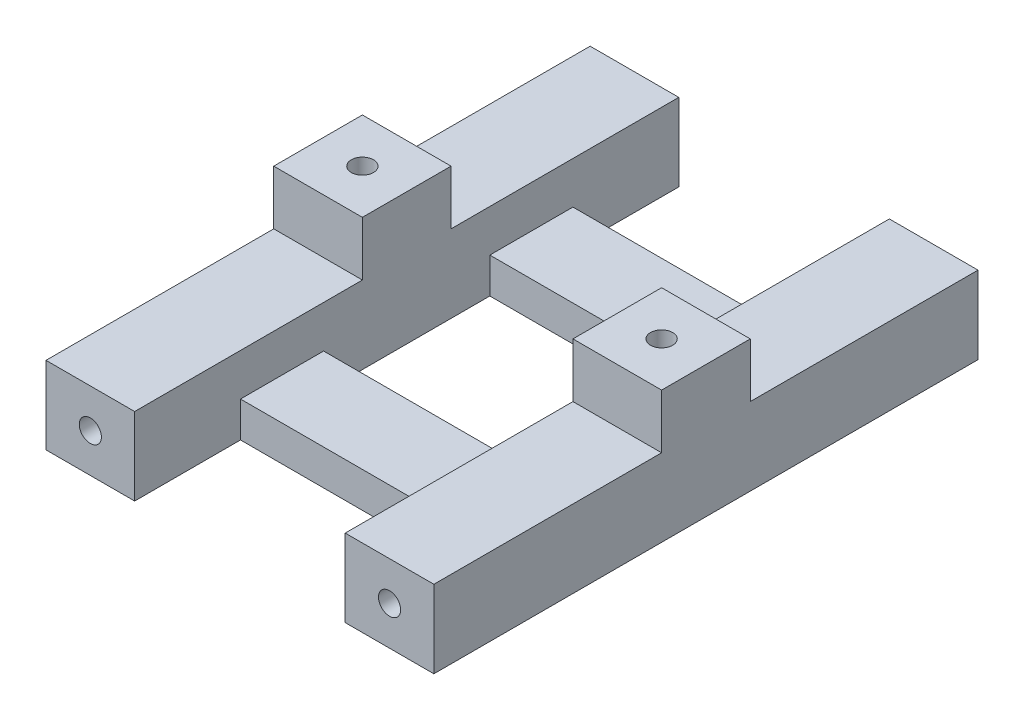
ISO-10303-21;
HEADER;
FILE_DESCRIPTION(('STEP AP214'),'2;1');
FILE_NAME('part.step','',(''),(''),'','','');
FILE_SCHEMA(('AUTOMOTIVE_DESIGN { 1 0 10303 214 1 1 1 1 }'));
ENDSEC;
DATA;
#1=APPLICATION_CONTEXT('core data for automotive mechanical design processes');
#2=APPLICATION_PROTOCOL_DEFINITION('international standard','automotive_design',2000,#1);
#3=PRODUCT_CONTEXT('',#1,'mechanical');
#4=PRODUCT('Part','Part','',(#3));
#5=PRODUCT_RELATED_PRODUCT_CATEGORY('part','',(#4));
#6=PRODUCT_DEFINITION_FORMATION('','',#4);
#7=PRODUCT_DEFINITION_CONTEXT('part definition',#1,'design');
#8=PRODUCT_DEFINITION('design','',#6,#7);
#9=PRODUCT_DEFINITION_SHAPE('','',#8);
#10=(LENGTH_UNIT() NAMED_UNIT(*) SI_UNIT(.MILLI.,.METRE.));
#11=(NAMED_UNIT(*) PLANE_ANGLE_UNIT() SI_UNIT($,.RADIAN.));
#12=(NAMED_UNIT(*) SI_UNIT($,.STERADIAN.) SOLID_ANGLE_UNIT());
#13=UNCERTAINTY_MEASURE_WITH_UNIT(LENGTH_MEASURE(1.E-05),#10,'distance_accuracy_value','');
#14=(GEOMETRIC_REPRESENTATION_CONTEXT(3) GLOBAL_UNCERTAINTY_ASSIGNED_CONTEXT((#13)) GLOBAL_UNIT_ASSIGNED_CONTEXT((#10,
#11,#12)) REPRESENTATION_CONTEXT('',''));
#15=CARTESIAN_POINT('',(0.,0.,0.));
#16=DIRECTION('',(0.,0.,1.));
#17=DIRECTION('',(1.,0.,0.));
#18=AXIS2_PLACEMENT_3D('',#15,#16,#17);
#19=CARTESIAN_POINT('',(0.,7.,0.));
#20=DIRECTION('',(0.,1.,0.));
#21=DIRECTION('',(0.,0.,1.));
#22=AXIS2_PLACEMENT_3D('',#19,#20,#21);
#23=PLANE('',#22);
#24=DIRECTION('',(0.,0.,-1.));
#25=VECTOR('',#24,1.);
#26=CARTESIAN_POINT('',(-10.407645754449,7.,24.6634549563666));
#27=LINE('',#26,#25);
#28=CARTESIAN_POINT('',(-10.407645754449,7.,24.6634549563666));
#29=VERTEX_POINT('',#28);
#30=CARTESIAN_POINT('',(-10.407645754449,7.,4.11345571930613));
#31=VERTEX_POINT('',#30);
#32=EDGE_CURVE('E452',#29,#31,#27,.T.);
#33=ORIENTED_EDGE('',*,*,#32,.T.);
#34=DIRECTION('',(1.,0.,0.));
#35=VECTOR('',#34,1.);
#36=CARTESIAN_POINT('',(-18.407645754449,7.,4.11345571930613));
#37=LINE('',#36,#35);
#38=CARTESIAN_POINT('',(-18.407645754449,7.,4.11345571930613));
#39=VERTEX_POINT('',#38);
#40=EDGE_CURVE('E359',#39,#31,#37,.T.);
#41=ORIENTED_EDGE('',*,*,#40,.F.);
#42=DIRECTION('',(0.,0.,1.));
#43=VECTOR('',#42,1.);
#44=CARTESIAN_POINT('',(-18.407645754449,7.,-24.4365435177544));
#45=LINE('',#44,#43);
#46=CARTESIAN_POINT('',(-18.407645754449,7.,24.6634549563666));
#47=VERTEX_POINT('',#46);
#48=EDGE_CURVE('E445',#39,#47,#45,.T.);
#49=ORIENTED_EDGE('',*,*,#48,.T.);
#50=DIRECTION('',(1.,0.,0.));
#51=VECTOR('',#50,1.);
#52=CARTESIAN_POINT('',(-18.407645754449,7.,24.6634549563666));
#53=LINE('',#52,#51);
#54=EDGE_CURVE('E449',#47,#29,#53,.T.);
#55=ORIENTED_EDGE('',*,*,#54,.T.);
#56=EDGE_LOOP('',(#33,#41,#49,#55));
#57=FACE_BOUND('',#56,.T.);
#58=ADVANCED_FACE('F38',(#57),#23,.T.);
#59=DIRECTION('',(-1.,0.,0.));
#60=VECTOR('',#59,1.);
#61=CARTESIAN_POINT('',(-18.407645754449,7.,-3.88654428069387));
#62=LINE('',#61,#60);
#63=CARTESIAN_POINT('',(-10.407645754449,7.,-3.88654428069387));
#64=VERTEX_POINT('',#63);
#65=CARTESIAN_POINT('',(-18.407645754449,7.,-3.88654428069387));
#66=VERTEX_POINT('',#65);
#67=EDGE_CURVE('E368',#64,#66,#62,.T.);
#68=ORIENTED_EDGE('',*,*,#67,.F.);
#69=DIRECTION('',(0.,0.,-1.));
#70=VECTOR('',#69,1.);
#71=CARTESIAN_POINT('',(-10.407645754449,7.,-14.8865442806934));
#72=LINE('',#71,#70);
#73=CARTESIAN_POINT('',(-10.407645754449,7.,-24.4365435177544));
#74=VERTEX_POINT('',#73);
#75=EDGE_CURVE('E317',#64,#74,#72,.T.);
#76=ORIENTED_EDGE('',*,*,#75,.T.);
#77=DIRECTION('',(-1.,0.,0.));
#78=VECTOR('',#77,1.);
#79=CARTESIAN_POINT('',(-10.407645754449,7.,-24.4365435177544));
#80=LINE('',#79,#78);
#81=CARTESIAN_POINT('',(-18.407645754449,7.,-24.4365435177544));
#82=VERTEX_POINT('',#81);
#83=EDGE_CURVE('E442',#74,#82,#80,.T.);
#84=ORIENTED_EDGE('',*,*,#83,.T.);
#85=EDGE_CURVE('E446',#82,#66,#45,.T.);
#86=ORIENTED_EDGE('',*,*,#85,.T.);
#87=EDGE_LOOP('',(#68,#76,#84,#86));
#88=FACE_BOUND('',#87,.T.);
#89=ADVANCED_FACE('F290',(#88),#23,.T.);
#90=DIRECTION('',(1.,0.,0.));
#91=VECTOR('',#90,1.);
#92=CARTESIAN_POINT('',(8.59235424555099,7.,4.11345571930613));
#93=LINE('',#92,#91);
#94=CARTESIAN_POINT('',(8.59235424555099,7.,4.11345571930613));
#95=VERTEX_POINT('',#94);
#96=CARTESIAN_POINT('',(16.592354245551,7.,4.11345571930613));
#97=VERTEX_POINT('',#96);
#98=EDGE_CURVE('E334',#95,#97,#93,.T.);
#99=ORIENTED_EDGE('',*,*,#98,.F.);
#100=DIRECTION('',(0.,0.,1.));
#101=VECTOR('',#100,1.);
#102=CARTESIAN_POINT('',(8.59235424555098,7.,15.1134557193066));
#103=LINE('',#102,#101);
#104=CARTESIAN_POINT('',(8.59235424555098,7.,24.6634549563666));
#105=VERTEX_POINT('',#104);
#106=EDGE_CURVE('E455',#95,#105,#103,.T.);
#107=ORIENTED_EDGE('',*,*,#106,.T.);
#108=DIRECTION('',(1.,0.,0.));
#109=VECTOR('',#108,1.);
#110=CARTESIAN_POINT('',(8.59235424555098,7.,24.6634549563666));
#111=LINE('',#110,#109);
#112=CARTESIAN_POINT('',(16.592354245551,7.,24.6634549563666));
#113=VERTEX_POINT('',#112);
#114=EDGE_CURVE('E428',#105,#113,#111,.T.);
#115=ORIENTED_EDGE('',*,*,#114,.T.);
#116=DIRECTION('',(0.,0.,-1.));
#117=VECTOR('',#116,1.);
#118=CARTESIAN_POINT('',(16.592354245551,7.,24.6634549563666));
#119=LINE('',#118,#117);
#120=EDGE_CURVE('E434',#113,#97,#119,.T.);
#121=ORIENTED_EDGE('',*,*,#120,.T.);
#122=EDGE_LOOP('',(#99,#107,#115,#121));
#123=FACE_BOUND('',#122,.T.);
#124=ADVANCED_FACE('F273',(#123),#23,.T.);
#125=DIRECTION('',(0.,0.,1.));
#126=VECTOR('',#125,1.);
#127=CARTESIAN_POINT('',(8.59235424555098,7.,-24.4365435177544));
#128=LINE('',#127,#126);
#129=CARTESIAN_POINT('',(8.59235424555098,7.,-24.4365435177544));
#130=VERTEX_POINT('',#129);
#131=CARTESIAN_POINT('',(8.59235424555098,7.,-3.88654428069387));
#132=VERTEX_POINT('',#131);
#133=EDGE_CURVE('E307',#130,#132,#128,.T.);
#134=ORIENTED_EDGE('',*,*,#133,.T.);
#135=DIRECTION('',(-1.,0.,0.));
#136=VECTOR('',#135,1.);
#137=CARTESIAN_POINT('',(8.59235424555098,7.,-3.88654428069387));
#138=LINE('',#137,#136);
#139=CARTESIAN_POINT('',(16.592354245551,7.,-3.88654428069387));
#140=VERTEX_POINT('',#139);
#141=EDGE_CURVE('E310',#140,#132,#138,.T.);
#142=ORIENTED_EDGE('',*,*,#141,.F.);
#143=CARTESIAN_POINT('',(16.592354245551,7.,-24.4365435177544));
#144=VERTEX_POINT('',#143);
#145=EDGE_CURVE('E432',#140,#144,#119,.T.);
#146=ORIENTED_EDGE('',*,*,#145,.T.);
#147=DIRECTION('',(-1.,0.,0.));
#148=VECTOR('',#147,1.);
#149=CARTESIAN_POINT('',(16.592354245551,7.,-24.4365435177544));
#150=LINE('',#149,#148);
#151=EDGE_CURVE('E313',#144,#130,#150,.T.);
#152=ORIENTED_EDGE('',*,*,#151,.T.);
#153=EDGE_LOOP('',(#134,#142,#146,#152));
#154=FACE_BOUND('',#153,.T.);
#155=ADVANCED_FACE('F282',(#154),#23,.T.);
#156=CARTESIAN_POINT('',(0.,0.,0.));
#157=DIRECTION('',(0.,1.,0.));
#158=DIRECTION('',(0.,0.,1.));
#159=AXIS2_PLACEMENT_3D('',#156,#157,#158);
#160=PLANE('',#159);
#161=DIRECTION('',(1.,0.,0.));
#162=VECTOR('',#161,1.);
#163=CARTESIAN_POINT('',(8.59235424555098,0.,24.6634549563666));
#164=LINE('',#163,#162);
#165=CARTESIAN_POINT('',(8.59235424555098,0.,24.6634549563666));
#166=VERTEX_POINT('',#165);
#167=CARTESIAN_POINT('',(16.592354245551,0.,24.6634549563666));
#168=VERTEX_POINT('',#167);
#169=EDGE_CURVE('E427',#166,#168,#164,.T.);
#170=ORIENTED_EDGE('',*,*,#169,.F.);
#171=DIRECTION('',(0.,0.,1.));
#172=VECTOR('',#171,1.);
#173=CARTESIAN_POINT('',(8.59235424555098,0.,15.1134557193066));
#174=LINE('',#173,#172);
#175=CARTESIAN_POINT('',(8.59235424555098,0.,15.1134557193066));
#176=VERTEX_POINT('',#175);
#177=EDGE_CURVE('E433',#176,#166,#174,.T.);
#178=ORIENTED_EDGE('',*,*,#177,.F.);
#179=DIRECTION('',(1.,0.,0.));
#180=VECTOR('',#179,1.);
#181=CARTESIAN_POINT('',(-10.407645754449,0.,15.1134557193066));
#182=LINE('',#181,#180);
#183=CARTESIAN_POINT('',(-10.407645754449,0.,15.1134557193066));
#184=VERTEX_POINT('',#183);
#185=EDGE_CURVE('E489',#184,#176,#182,.T.);
#186=ORIENTED_EDGE('',*,*,#185,.F.);
#187=DIRECTION('',(0.,0.,-1.));
#188=VECTOR('',#187,1.);
#189=CARTESIAN_POINT('',(-10.407645754449,0.,24.6634549563666));
#190=LINE('',#189,#188);
#191=CARTESIAN_POINT('',(-10.407645754449,0.,24.6634549563666));
#192=VERTEX_POINT('',#191);
#193=EDGE_CURVE('E220',#192,#184,#190,.T.);
#194=ORIENTED_EDGE('',*,*,#193,.F.);
#195=DIRECTION('',(1.,0.,0.));
#196=VECTOR('',#195,1.);
#197=CARTESIAN_POINT('',(-18.407645754449,0.,24.6634549563666));
#198=LINE('',#197,#196);
#199=CARTESIAN_POINT('',(-18.407645754449,0.,24.6634549563666));
#200=VERTEX_POINT('',#199);
#201=EDGE_CURVE('E484',#200,#192,#198,.T.);
#202=ORIENTED_EDGE('',*,*,#201,.F.);
#203=DIRECTION('',(0.,0.,1.));
#204=VECTOR('',#203,1.);
#205=CARTESIAN_POINT('',(-18.407645754449,0.,-24.4365435177544));
#206=LINE('',#205,#204);
#207=CARTESIAN_POINT('',(-18.407645754449,0.,-24.4365435177544));
#208=VERTEX_POINT('',#207);
#209=EDGE_CURVE('E481',#208,#200,#206,.T.);
#210=ORIENTED_EDGE('',*,*,#209,.F.);
#211=DIRECTION('',(-1.,0.,0.));
#212=VECTOR('',#211,1.);
#213=CARTESIAN_POINT('',(-10.407645754449,0.,-24.4365435177544));
#214=LINE('',#213,#212);
#215=CARTESIAN_POINT('',(-10.407645754449,0.,-24.4365435177544));
#216=VERTEX_POINT('',#215);
#217=EDGE_CURVE('E478',#216,#208,#214,.T.);
#218=ORIENTED_EDGE('',*,*,#217,.F.);
#219=DIRECTION('',(0.,0.,-1.));
#220=VECTOR('',#219,1.);
#221=CARTESIAN_POINT('',(-10.407645754449,0.,-14.8865442806934));
#222=LINE('',#221,#220);
#223=CARTESIAN_POINT('',(-10.407645754449,0.,-14.8865442806934));
#224=VERTEX_POINT('',#223);
#225=EDGE_CURVE('E475',#224,#216,#222,.T.);
#226=ORIENTED_EDGE('',*,*,#225,.F.);
#227=DIRECTION('',(-1.,0.,0.));
#228=VECTOR('',#227,1.);
#229=CARTESIAN_POINT('',(8.59235424555098,0.,-14.8865442806934));
#230=LINE('',#229,#228);
#231=CARTESIAN_POINT('',(8.59235424555098,0.,-14.8865442806934));
#232=VERTEX_POINT('',#231);
#233=EDGE_CURVE('E471',#232,#224,#230,.T.);
#234=ORIENTED_EDGE('',*,*,#233,.F.);
#235=DIRECTION('',(0.,0.,1.));
#236=VECTOR('',#235,1.);
#237=CARTESIAN_POINT('',(8.59235424555098,0.,-24.4365435177544));
#238=LINE('',#237,#236);
#239=CARTESIAN_POINT('',(8.59235424555098,0.,-24.4365435177544));
#240=VERTEX_POINT('',#239);
#241=EDGE_CURVE('E467',#240,#232,#238,.T.);
#242=ORIENTED_EDGE('',*,*,#241,.F.);
#243=DIRECTION('',(-1.,0.,0.));
#244=VECTOR('',#243,1.);
#245=CARTESIAN_POINT('',(16.592354245551,0.,-24.4365435177544));
#246=LINE('',#245,#244);
#247=CARTESIAN_POINT('',(16.592354245551,0.,-24.4365435177544));
#248=VERTEX_POINT('',#247);
#249=EDGE_CURVE('E464',#248,#240,#246,.T.);
#250=ORIENTED_EDGE('',*,*,#249,.F.);
#251=DIRECTION('',(0.,0.,-1.));
#252=VECTOR('',#251,1.);
#253=CARTESIAN_POINT('',(16.592354245551,0.,24.6634549563666));
#254=LINE('',#253,#252);
#255=EDGE_CURVE('E461',#168,#248,#254,.T.);
#256=ORIENTED_EDGE('',*,*,#255,.F.);
#257=EDGE_LOOP('',(#170,#178,#186,#194,#202,#210,#218,#226,#234,#242,#250,#256));
#258=FACE_BOUND('',#257,.T.);
#259=DIRECTION('',(0.,0.,1.));
#260=VECTOR('',#259,1.);
#261=CARTESIAN_POINT('',(-10.407645754449,0.,-7.38654428069337));
#262=LINE('',#261,#260);
#263=CARTESIAN_POINT('',(-10.407645754449,0.,-7.38654428069337));
#264=VERTEX_POINT('',#263);
#265=CARTESIAN_POINT('',(-10.407645754449,0.,7.61345571930663));
#266=VERTEX_POINT('',#265);
#267=EDGE_CURVE('E399',#264,#266,#262,.T.);
#268=ORIENTED_EDGE('',*,*,#267,.T.);
#269=DIRECTION('',(1.,0.,0.));
#270=VECTOR('',#269,1.);
#271=CARTESIAN_POINT('',(-10.407645754449,0.,7.61345571930663));
#272=LINE('',#271,#270);
#273=CARTESIAN_POINT('',(8.59235424555098,0.,7.61345571930663));
#274=VERTEX_POINT('',#273);
#275=EDGE_CURVE('E403',#266,#274,#272,.T.);
#276=ORIENTED_EDGE('',*,*,#275,.T.);
#277=DIRECTION('',(0.,0.,-1.));
#278=VECTOR('',#277,1.);
#279=CARTESIAN_POINT('',(8.59235424555098,0.,-7.38654428069337));
#280=LINE('',#279,#278);
#281=CARTESIAN_POINT('',(8.59235424555098,0.,-7.38654428069337));
#282=VERTEX_POINT('',#281);
#283=EDGE_CURVE('E407',#274,#282,#280,.T.);
#284=ORIENTED_EDGE('',*,*,#283,.T.);
#285=DIRECTION('',(-1.,0.,0.));
#286=VECTOR('',#285,1.);
#287=CARTESIAN_POINT('',(-10.407645754449,0.,-7.38654428069337));
#288=LINE('',#287,#286);
#289=EDGE_CURVE('E411',#282,#264,#288,.T.);
#290=ORIENTED_EDGE('',*,*,#289,.T.);
#291=EDGE_LOOP('',(#268,#276,#284,#290));
#292=FACE_BOUND('',#291,.T.);
#293=ADVANCED_FACE('F299',(#258,#292),#160,.F.);
#294=CARTESIAN_POINT('',(8.59235424555098,7.,24.6634549563666));
#295=DIRECTION('',(0.,0.,-1.));
#296=DIRECTION('',(-1.,0.,0.));
#297=AXIS2_PLACEMENT_3D('',#294,#295,#296);
#298=PLANE('',#297);
#299=CARTESIAN_POINT('',(12.592354245551,3.5,24.6634549563666));
#300=DIRECTION('',(0.,0.,1.));
#301=DIRECTION('',(1.,0.,0.));
#302=AXIS2_PLACEMENT_3D('',#299,#300,#301);
#303=CIRCLE('',#302,1.);
#304=CARTESIAN_POINT('',(13.592354245551,3.5,24.6634549563666));
#305=VERTEX_POINT('',#304);
#306=EDGE_CURVE('E537',#305,#305,#303,.T.);
#307=ORIENTED_EDGE('',*,*,#306,.F.);
#308=EDGE_LOOP('',(#307));
#309=FACE_BOUND('',#308,.T.);
#310=ORIENTED_EDGE('',*,*,#169,.T.);
#311=DIRECTION('',(0.,-1.,0.));
#312=VECTOR('',#311,1.);
#313=CARTESIAN_POINT('',(16.592354245551,7.,24.6634549563666));
#314=LINE('',#313,#312);
#315=EDGE_CURVE('E258',#113,#168,#314,.T.);
#316=ORIENTED_EDGE('',*,*,#315,.F.);
#317=ORIENTED_EDGE('',*,*,#114,.F.);
#318=DIRECTION('',(0.,-1.,0.));
#319=VECTOR('',#318,1.);
#320=CARTESIAN_POINT('',(8.59235424555098,7.,24.6634549563666));
#321=LINE('',#320,#319);
#322=EDGE_CURVE('E229',#105,#166,#321,.T.);
#323=ORIENTED_EDGE('',*,*,#322,.T.);
#324=EDGE_LOOP('',(#310,#316,#317,#323));
#325=FACE_BOUND('',#324,.T.);
#326=ADVANCED_FACE('F40',(#309,#325),#298,.F.);
#327=CARTESIAN_POINT('',(16.592354245551,7.,24.6634549563666));
#328=DIRECTION('',(-1.,0.,0.));
#329=DIRECTION('',(0.,0.,1.));
#330=AXIS2_PLACEMENT_3D('',#327,#328,#329);
#331=PLANE('',#330);
#332=ORIENTED_EDGE('',*,*,#255,.T.);
#333=DIRECTION('',(0.,-1.,0.));
#334=VECTOR('',#333,1.);
#335=CARTESIAN_POINT('',(16.592354245551,7.,-24.4365435177544));
#336=LINE('',#335,#334);
#337=EDGE_CURVE('E254',#144,#248,#336,.T.);
#338=ORIENTED_EDGE('',*,*,#337,.F.);
#339=ORIENTED_EDGE('',*,*,#145,.F.);
#340=DIRECTION('',(0.,-1.,0.));
#341=VECTOR('',#340,1.);
#342=CARTESIAN_POINT('',(16.592354245551,11.9,-3.88654428069387));
#343=LINE('',#342,#341);
#344=CARTESIAN_POINT('',(16.592354245551,11.9,-3.88654428069387));
#345=VERTEX_POINT('',#344);
#346=EDGE_CURVE('E329',#345,#140,#343,.T.);
#347=ORIENTED_EDGE('',*,*,#346,.F.);
#348=DIRECTION('',(0.,0.,-1.));
#349=VECTOR('',#348,1.);
#350=CARTESIAN_POINT('',(16.592354245551,11.9,-3.88654428069387));
#351=LINE('',#350,#349);
#352=CARTESIAN_POINT('',(16.592354245551,11.9,4.11345571930613));
#353=VERTEX_POINT('',#352);
#354=EDGE_CURVE('E514',#353,#345,#351,.T.);
#355=ORIENTED_EDGE('',*,*,#354,.F.);
#356=DIRECTION('',(0.,-1.,0.));
#357=VECTOR('',#356,1.);
#358=CARTESIAN_POINT('',(16.592354245551,11.9,4.11345571930613));
#359=LINE('',#358,#357);
#360=EDGE_CURVE('E346',#353,#97,#359,.T.);
#361=ORIENTED_EDGE('',*,*,#360,.T.);
#362=ORIENTED_EDGE('',*,*,#120,.F.);
#363=ORIENTED_EDGE('',*,*,#315,.T.);
#364=EDGE_LOOP('',(#332,#338,#339,#347,#355,#361,#362,#363));
#365=FACE_BOUND('',#364,.T.);
#366=ADVANCED_FACE('F506',(#365),#331,.F.);
#367=CARTESIAN_POINT('',(16.592354245551,7.,-24.4365435177544));
#368=DIRECTION('',(0.,0.,1.));
#369=DIRECTION('',(1.,0.,0.));
#370=AXIS2_PLACEMENT_3D('',#367,#368,#369);
#371=PLANE('',#370);
#372=CARTESIAN_POINT('',(12.592354245551,3.5,-24.4365435177544));
#373=DIRECTION('',(0.,0.,1.));
#374=DIRECTION('',(1.,0.,0.));
#375=AXIS2_PLACEMENT_3D('',#372,#373,#374);
#376=CIRCLE('',#375,1.);
#377=CARTESIAN_POINT('',(13.592354245551,3.5,-24.4365435177544));
#378=VERTEX_POINT('',#377);
#379=EDGE_CURVE('E42',#378,#378,#376,.T.);
#380=ORIENTED_EDGE('',*,*,#379,.T.);
#381=EDGE_LOOP('',(#380));
#382=FACE_BOUND('',#381,.T.);
#383=ORIENTED_EDGE('',*,*,#249,.T.);
#384=DIRECTION('',(0.,-1.,0.));
#385=VECTOR('',#384,1.);
#386=CARTESIAN_POINT('',(8.59235424555098,7.,-24.4365435177544));
#387=LINE('',#386,#385);
#388=EDGE_CURVE('E250',#130,#240,#387,.T.);
#389=ORIENTED_EDGE('',*,*,#388,.F.);
#390=ORIENTED_EDGE('',*,*,#151,.F.);
#391=ORIENTED_EDGE('',*,*,#337,.T.);
#392=EDGE_LOOP('',(#383,#389,#390,#391));
#393=FACE_BOUND('',#392,.T.);
#394=ADVANCED_FACE('F555',(#382,#393),#371,.F.);
#395=CARTESIAN_POINT('',(8.59235424555098,7.,-14.8865442806934));
#396=DIRECTION('',(0.,0.,1.));
#397=DIRECTION('',(1.,0.,0.));
#398=AXIS2_PLACEMENT_3D('',#395,#396,#397);
#399=PLANE('',#398);
#400=DIRECTION('',(0.,-1.,0.));
#401=VECTOR('',#400,1.);
#402=CARTESIAN_POINT('',(-10.407645754449,7.,-14.8865442806934));
#403=LINE('',#402,#401);
#404=CARTESIAN_POINT('',(-10.407645754449,3.2,-14.8865442806934));
#405=VERTEX_POINT('',#404);
#406=EDGE_CURVE('E244',#405,#224,#403,.T.);
#407=ORIENTED_EDGE('',*,*,#406,.F.);
#408=DIRECTION('',(1.,0.,0.));
#409=VECTOR('',#408,1.);
#410=CARTESIAN_POINT('',(8.59235424555098,3.2,-14.8865442806934));
#411=LINE('',#410,#409);
#412=CARTESIAN_POINT('',(8.59235424555098,3.2,-14.8865442806934));
#413=VERTEX_POINT('',#412);
#414=EDGE_CURVE('E524',#405,#413,#411,.T.);
#415=ORIENTED_EDGE('',*,*,#414,.T.);
#416=DIRECTION('',(0.,-1.,0.));
#417=VECTOR('',#416,1.);
#418=CARTESIAN_POINT('',(8.59235424555098,7.,-14.8865442806934));
#419=LINE('',#418,#417);
#420=EDGE_CURVE('E247',#413,#232,#419,.T.);
#421=ORIENTED_EDGE('',*,*,#420,.T.);
#422=ORIENTED_EDGE('',*,*,#233,.T.);
#423=EDGE_LOOP('',(#407,#415,#421,#422));
#424=FACE_BOUND('',#423,.T.);
#425=ADVANCED_FACE('F559',(#424),#399,.F.);
#426=CARTESIAN_POINT('',(-10.407645754449,7.,-24.4365435177544));
#427=DIRECTION('',(0.,0.,1.));
#428=DIRECTION('',(1.,0.,0.));
#429=AXIS2_PLACEMENT_3D('',#426,#427,#428);
#430=PLANE('',#429);
#431=CARTESIAN_POINT('',(-14.407645754449,3.5,-24.4365435177544));
#432=DIRECTION('',(0.,0.,1.));
#433=DIRECTION('',(1.,0.,0.));
#434=AXIS2_PLACEMENT_3D('',#431,#432,#433);
#435=CIRCLE('',#434,1.);
#436=CARTESIAN_POINT('',(-13.407645754449,3.5,-24.4365435177544));
#437=VERTEX_POINT('',#436);
#438=EDGE_CURVE('E533',#437,#437,#435,.T.);
#439=ORIENTED_EDGE('',*,*,#438,.T.);
#440=EDGE_LOOP('',(#439));
#441=FACE_BOUND('',#440,.T.);
#442=ORIENTED_EDGE('',*,*,#217,.T.);
#443=DIRECTION('',(0.,-1.,0.));
#444=VECTOR('',#443,1.);
#445=CARTESIAN_POINT('',(-18.407645754449,7.,-24.4365435177544));
#446=LINE('',#445,#444);
#447=EDGE_CURVE('E236',#82,#208,#446,.T.);
#448=ORIENTED_EDGE('',*,*,#447,.F.);
#449=ORIENTED_EDGE('',*,*,#83,.F.);
#450=DIRECTION('',(0.,-1.,0.));
#451=VECTOR('',#450,1.);
#452=CARTESIAN_POINT('',(-10.407645754449,7.,-24.4365435177544));
#453=LINE('',#452,#451);
#454=EDGE_CURVE('E240',#74,#216,#453,.T.);
#455=ORIENTED_EDGE('',*,*,#454,.T.);
#456=EDGE_LOOP('',(#442,#448,#449,#455));
#457=FACE_BOUND('',#456,.T.);
#458=ADVANCED_FACE('F565',(#441,#457),#430,.F.);
#459=CARTESIAN_POINT('',(-18.407645754449,7.,-24.4365435177544));
#460=DIRECTION('',(1.,0.,0.));
#461=DIRECTION('',(0.,0.,-1.));
#462=AXIS2_PLACEMENT_3D('',#459,#460,#461);
#463=PLANE('',#462);
#464=ORIENTED_EDGE('',*,*,#209,.T.);
#465=DIRECTION('',(0.,-1.,0.));
#466=VECTOR('',#465,1.);
#467=CARTESIAN_POINT('',(-18.407645754449,7.,24.6634549563666));
#468=LINE('',#467,#466);
#469=EDGE_CURVE('E227',#47,#200,#468,.T.);
#470=ORIENTED_EDGE('',*,*,#469,.F.);
#471=ORIENTED_EDGE('',*,*,#48,.F.);
#472=DIRECTION('',(0.,-1.,0.));
#473=VECTOR('',#472,1.);
#474=CARTESIAN_POINT('',(-18.407645754449,11.9,4.11345571930613));
#475=LINE('',#474,#473);
#476=CARTESIAN_POINT('',(-18.407645754449,11.9,4.11345571930613));
#477=VERTEX_POINT('',#476);
#478=EDGE_CURVE('E395',#477,#39,#475,.T.);
#479=ORIENTED_EDGE('',*,*,#478,.F.);
#480=DIRECTION('',(0.,0.,1.));
#481=VECTOR('',#480,1.);
#482=CARTESIAN_POINT('',(-18.407645754449,11.9,-3.88654428069387));
#483=LINE('',#482,#481);
#484=CARTESIAN_POINT('',(-18.407645754449,11.9,-3.88654428069387));
#485=VERTEX_POINT('',#484);
#486=EDGE_CURVE('E363',#485,#477,#483,.T.);
#487=ORIENTED_EDGE('',*,*,#486,.F.);
#488=DIRECTION('',(0.,-1.,0.));
#489=VECTOR('',#488,1.);
#490=CARTESIAN_POINT('',(-18.407645754449,11.9,-3.88654428069387));
#491=LINE('',#490,#489);
#492=EDGE_CURVE('E377',#485,#66,#491,.T.);
#493=ORIENTED_EDGE('',*,*,#492,.T.);
#494=ORIENTED_EDGE('',*,*,#85,.F.);
#495=ORIENTED_EDGE('',*,*,#447,.T.);
#496=EDGE_LOOP('',(#464,#470,#471,#479,#487,#493,#494,#495));
#497=FACE_BOUND('',#496,.T.);
#498=ADVANCED_FACE('F569',(#497),#463,.F.);
#499=CARTESIAN_POINT('',(-18.407645754449,7.,24.6634549563666));
#500=DIRECTION('',(0.,0.,-1.));
#501=DIRECTION('',(-1.,0.,0.));
#502=AXIS2_PLACEMENT_3D('',#499,#500,#501);
#503=PLANE('',#502);
#504=CARTESIAN_POINT('',(-14.407645754449,3.5,24.6634549563666));
#505=DIRECTION('',(0.,0.,1.));
#506=DIRECTION('',(1.,0.,0.));
#507=AXIS2_PLACEMENT_3D('',#504,#505,#506);
#508=CIRCLE('',#507,1.);
#509=CARTESIAN_POINT('',(-13.407645754449,3.5,24.6634549563666));
#510=VERTEX_POINT('',#509);
#511=EDGE_CURVE('E538',#510,#510,#508,.T.);
#512=ORIENTED_EDGE('',*,*,#511,.F.);
#513=EDGE_LOOP('',(#512));
#514=FACE_BOUND('',#513,.T.);
#515=ORIENTED_EDGE('',*,*,#201,.T.);
#516=DIRECTION('',(0.,-1.,0.));
#517=VECTOR('',#516,1.);
#518=CARTESIAN_POINT('',(-10.407645754449,7.,24.6634549563666));
#519=LINE('',#518,#517);
#520=EDGE_CURVE('E223',#29,#192,#519,.T.);
#521=ORIENTED_EDGE('',*,*,#520,.F.);
#522=ORIENTED_EDGE('',*,*,#54,.F.);
#523=ORIENTED_EDGE('',*,*,#469,.T.);
#524=EDGE_LOOP('',(#515,#521,#522,#523));
#525=FACE_BOUND('',#524,.T.);
#526=ADVANCED_FACE('F573',(#514,#525),#503,.F.);
#527=CARTESIAN_POINT('',(-10.407645754449,7.,24.6634549563666));
#528=DIRECTION('',(-1.,0.,0.));
#529=DIRECTION('',(0.,0.,1.));
#530=AXIS2_PLACEMENT_3D('',#527,#528,#529);
#531=PLANE('',#530);
#532=ORIENTED_EDGE('',*,*,#193,.T.);
#533=DIRECTION('',(0.,-1.,0.));
#534=VECTOR('',#533,1.);
#535=CARTESIAN_POINT('',(-10.407645754449,7.,15.1134557193066));
#536=LINE('',#535,#534);
#537=CARTESIAN_POINT('',(-10.407645754449,3.2,15.1134557193066));
#538=VERTEX_POINT('',#537);
#539=EDGE_CURVE('E212',#538,#184,#536,.T.);
#540=ORIENTED_EDGE('',*,*,#539,.F.);
#541=DIRECTION('',(0.,0.,1.));
#542=VECTOR('',#541,1.);
#543=CARTESIAN_POINT('',(-10.407645754449,3.2,-22.7865442806934));
#544=LINE('',#543,#542);
#545=CARTESIAN_POINT('',(-10.407645754449,3.2,7.61345571930663));
#546=VERTEX_POINT('',#545);
#547=EDGE_CURVE('E198',#546,#538,#544,.T.);
#548=ORIENTED_EDGE('',*,*,#547,.F.);
#549=DIRECTION('',(0.,-1.,0.));
#550=VECTOR('',#549,1.);
#551=CARTESIAN_POINT('',(-10.407645754449,7.,7.61345571930663));
#552=LINE('',#551,#550);
#553=EDGE_CURVE('E424',#546,#266,#552,.T.);
#554=ORIENTED_EDGE('',*,*,#553,.T.);
#555=ORIENTED_EDGE('',*,*,#267,.F.);
#556=DIRECTION('',(0.,-1.,0.));
#557=VECTOR('',#556,1.);
#558=CARTESIAN_POINT('',(-10.407645754449,7.,-7.38654428069337));
#559=LINE('',#558,#557);
#560=CARTESIAN_POINT('',(-10.407645754449,3.2,-7.38654428069337));
#561=VERTEX_POINT('',#560);
#562=EDGE_CURVE('E415',#561,#264,#559,.T.);
#563=ORIENTED_EDGE('',*,*,#562,.F.);
#564=EDGE_CURVE('E62',#405,#561,#544,.T.);
#565=ORIENTED_EDGE('',*,*,#564,.F.);
#566=ORIENTED_EDGE('',*,*,#406,.T.);
#567=ORIENTED_EDGE('',*,*,#225,.T.);
#568=ORIENTED_EDGE('',*,*,#454,.F.);
#569=ORIENTED_EDGE('',*,*,#75,.F.);
#570=DIRECTION('',(0.,-1.,0.));
#571=VECTOR('',#570,1.);
#572=CARTESIAN_POINT('',(-10.407645754449,11.9,-3.88654428069388));
#573=LINE('',#572,#571);
#574=CARTESIAN_POINT('',(-10.407645754449,11.9,-3.88654428069388));
#575=VERTEX_POINT('',#574);
#576=EDGE_CURVE('E387',#575,#64,#573,.T.);
#577=ORIENTED_EDGE('',*,*,#576,.F.);
#578=DIRECTION('',(0.,0.,-1.));
#579=VECTOR('',#578,1.);
#580=CARTESIAN_POINT('',(-10.407645754449,11.9,-3.88654428069388));
#581=LINE('',#580,#579);
#582=CARTESIAN_POINT('',(-10.407645754449,11.9,4.11345571930613));
#583=VERTEX_POINT('',#582);
#584=EDGE_CURVE('E371',#583,#575,#581,.T.);
#585=ORIENTED_EDGE('',*,*,#584,.F.);
#586=DIRECTION('',(0.,-1.,0.));
#587=VECTOR('',#586,1.);
#588=CARTESIAN_POINT('',(-10.407645754449,11.9,4.11345571930613));
#589=LINE('',#588,#587);
#590=EDGE_CURVE('E391',#583,#31,#589,.T.);
#591=ORIENTED_EDGE('',*,*,#590,.T.);
#592=ORIENTED_EDGE('',*,*,#32,.F.);
#593=ORIENTED_EDGE('',*,*,#520,.T.);
#594=EDGE_LOOP('',(#532,#540,#548,#554,#555,#563,#565,#566,#567,#568,#569,#577,#585,#591,#592,#593));
#595=FACE_BOUND('',#594,.T.);
#596=ADVANCED_FACE('F217',(#595),#531,.F.);
#597=CARTESIAN_POINT('',(-10.407645754449,7.,15.1134557193066));
#598=DIRECTION('',(0.,0.,-1.));
#599=DIRECTION('',(-1.,0.,0.));
#600=AXIS2_PLACEMENT_3D('',#597,#598,#599);
#601=PLANE('',#600);
#602=DIRECTION('',(0.,-1.,0.));
#603=VECTOR('',#602,1.);
#604=CARTESIAN_POINT('',(8.59235424555098,7.,15.1134557193066));
#605=LINE('',#604,#603);
#606=CARTESIAN_POINT('',(8.59235424555098,3.2,15.1134557193066));
#607=VERTEX_POINT('',#606);
#608=EDGE_CURVE('E214',#607,#176,#605,.T.);
#609=ORIENTED_EDGE('',*,*,#608,.F.);
#610=DIRECTION('',(1.,0.,0.));
#611=VECTOR('',#610,1.);
#612=CARTESIAN_POINT('',(-10.407645754449,3.2,15.1134557193066));
#613=LINE('',#612,#611);
#614=EDGE_CURVE('E201',#538,#607,#613,.T.);
#615=ORIENTED_EDGE('',*,*,#614,.F.);
#616=ORIENTED_EDGE('',*,*,#539,.T.);
#617=ORIENTED_EDGE('',*,*,#185,.T.);
#618=EDGE_LOOP('',(#609,#615,#616,#617));
#619=FACE_BOUND('',#618,.T.);
#620=ADVANCED_FACE('F210',(#619),#601,.F.);
#621=CARTESIAN_POINT('',(8.59235424555098,7.,15.1134557193066));
#622=DIRECTION('',(1.,0.,0.));
#623=DIRECTION('',(0.,0.,-1.));
#624=AXIS2_PLACEMENT_3D('',#621,#622,#623);
#625=PLANE('',#624);
#626=ORIENTED_EDGE('',*,*,#177,.T.);
#627=ORIENTED_EDGE('',*,*,#322,.F.);
#628=ORIENTED_EDGE('',*,*,#106,.F.);
#629=DIRECTION('',(0.,-1.,0.));
#630=VECTOR('',#629,1.);
#631=CARTESIAN_POINT('',(8.59235424555099,11.9,4.11345571930613));
#632=LINE('',#631,#630);
#633=CARTESIAN_POINT('',(8.59235424555099,11.9,4.11345571930613));
#634=VERTEX_POINT('',#633);
#635=EDGE_CURVE('E350',#634,#95,#632,.T.);
#636=ORIENTED_EDGE('',*,*,#635,.F.);
#637=DIRECTION('',(0.,0.,1.));
#638=VECTOR('',#637,1.);
#639=CARTESIAN_POINT('',(8.59235424555098,11.9,-3.88654428069387));
#640=LINE('',#639,#638);
#641=CARTESIAN_POINT('',(8.59235424555098,11.9,-3.88654428069387));
#642=VERTEX_POINT('',#641);
#643=EDGE_CURVE('E325',#642,#634,#640,.T.);
#644=ORIENTED_EDGE('',*,*,#643,.F.);
#645=DIRECTION('',(0.,-1.,0.));
#646=VECTOR('',#645,1.);
#647=CARTESIAN_POINT('',(8.59235424555098,11.9,-3.88654428069387));
#648=LINE('',#647,#646);
#649=EDGE_CURVE('E321',#642,#132,#648,.T.);
#650=ORIENTED_EDGE('',*,*,#649,.T.);
#651=ORIENTED_EDGE('',*,*,#133,.F.);
#652=ORIENTED_EDGE('',*,*,#388,.T.);
#653=ORIENTED_EDGE('',*,*,#241,.T.);
#654=ORIENTED_EDGE('',*,*,#420,.F.);
#655=DIRECTION('',(0.,0.,1.));
#656=VECTOR('',#655,1.);
#657=CARTESIAN_POINT('',(8.59235424555098,3.2,-22.7865442806934));
#658=LINE('',#657,#656);
#659=CARTESIAN_POINT('',(8.59235424555098,3.2,-7.38654428069337));
#660=VERTEX_POINT('',#659);
#661=EDGE_CURVE('E529',#413,#660,#658,.T.);
#662=ORIENTED_EDGE('',*,*,#661,.T.);
#663=DIRECTION('',(0.,-1.,0.));
#664=VECTOR('',#663,1.);
#665=CARTESIAN_POINT('',(8.59235424555098,7.,-7.38654428069337));
#666=LINE('',#665,#664);
#667=EDGE_CURVE('E418',#660,#282,#666,.T.);
#668=ORIENTED_EDGE('',*,*,#667,.T.);
#669=ORIENTED_EDGE('',*,*,#283,.F.);
#670=DIRECTION('',(0.,-1.,0.));
#671=VECTOR('',#670,1.);
#672=CARTESIAN_POINT('',(8.59235424555098,7.,7.61345571930663));
#673=LINE('',#672,#671);
#674=CARTESIAN_POINT('',(8.59235424555098,3.2,7.61345571930663));
#675=VERTEX_POINT('',#674);
#676=EDGE_CURVE('E421',#675,#274,#673,.T.);
#677=ORIENTED_EDGE('',*,*,#676,.F.);
#678=EDGE_CURVE('E55',#675,#607,#658,.T.);
#679=ORIENTED_EDGE('',*,*,#678,.T.);
#680=ORIENTED_EDGE('',*,*,#608,.T.);
#681=EDGE_LOOP('',(#626,#627,#628,#636,#644,#650,#651,#652,#653,#654,#662,#668,#669,#677,#679,#680));
#682=FACE_BOUND('',#681,.T.);
#683=ADVANCED_FACE('F322',(#682),#625,.F.);
#684=CARTESIAN_POINT('',(-10.407645754449,7.,7.61345571930663));
#685=DIRECTION('',(0.,0.,-1.));
#686=DIRECTION('',(-1.,0.,0.));
#687=AXIS2_PLACEMENT_3D('',#684,#685,#686);
#688=PLANE('',#687);
#689=DIRECTION('',(-1.,0.,0.));
#690=VECTOR('',#689,1.);
#691=CARTESIAN_POINT('',(-10.407645754449,3.2,7.61345571930663));
#692=LINE('',#691,#690);
#693=EDGE_CURVE('E203',#675,#546,#692,.T.);
#694=ORIENTED_EDGE('',*,*,#693,.F.);
#695=ORIENTED_EDGE('',*,*,#676,.T.);
#696=ORIENTED_EDGE('',*,*,#275,.F.);
#697=ORIENTED_EDGE('',*,*,#553,.F.);
#698=EDGE_LOOP('',(#694,#695,#696,#697));
#699=FACE_BOUND('',#698,.T.);
#700=ADVANCED_FACE('F583',(#699),#688,.T.);
#701=CARTESIAN_POINT('',(-10.407645754449,7.,-7.38654428069337));
#702=DIRECTION('',(0.,0.,1.));
#703=DIRECTION('',(1.,0.,0.));
#704=AXIS2_PLACEMENT_3D('',#701,#702,#703);
#705=PLANE('',#704);
#706=DIRECTION('',(1.,0.,0.));
#707=VECTOR('',#706,1.);
#708=CARTESIAN_POINT('',(-10.407645754449,3.2,-7.38654428069337));
#709=LINE('',#708,#707);
#710=EDGE_CURVE('E11',#561,#660,#709,.T.);
#711=ORIENTED_EDGE('',*,*,#710,.F.);
#712=ORIENTED_EDGE('',*,*,#562,.T.);
#713=ORIENTED_EDGE('',*,*,#289,.F.);
#714=ORIENTED_EDGE('',*,*,#667,.F.);
#715=EDGE_LOOP('',(#711,#712,#713,#714));
#716=FACE_BOUND('',#715,.T.);
#717=ADVANCED_FACE('F587',(#716),#705,.T.);
#718=CARTESIAN_POINT('',(0.,11.9,0.));
#719=DIRECTION('',(0.,1.,0.));
#720=DIRECTION('',(0.,0.,1.));
#721=AXIS2_PLACEMENT_3D('',#718,#719,#720);
#722=PLANE('',#721);
#723=ORIENTED_EDGE('',*,*,#486,.T.);
#724=DIRECTION('',(1.,0.,0.));
#725=VECTOR('',#724,1.);
#726=CARTESIAN_POINT('',(-18.407645754449,11.9,4.11345571930613));
#727=LINE('',#726,#725);
#728=EDGE_CURVE('E367',#477,#583,#727,.T.);
#729=ORIENTED_EDGE('',*,*,#728,.T.);
#730=ORIENTED_EDGE('',*,*,#584,.T.);
#731=DIRECTION('',(-1.,0.,0.));
#732=VECTOR('',#731,1.);
#733=CARTESIAN_POINT('',(-18.407645754449,11.9,-3.88654428069387));
#734=LINE('',#733,#732);
#735=EDGE_CURVE('E374',#575,#485,#734,.T.);
#736=ORIENTED_EDGE('',*,*,#735,.T.);
#737=EDGE_LOOP('',(#723,#729,#730,#736));
#738=FACE_BOUND('',#737,.T.);
#739=CARTESIAN_POINT('',(-14.407645754449,11.9,0.113455719306127));
#740=DIRECTION('',(0.,1.,0.));
#741=DIRECTION('',(0.,0.,1.));
#742=AXIS2_PLACEMENT_3D('',#739,#740,#741);
#743=CIRCLE('',#742,1.);
#744=CARTESIAN_POINT('',(-14.407645754449,11.9,1.11345571930613));
#745=VERTEX_POINT('',#744);
#746=EDGE_CURVE('E355',#745,#745,#743,.T.);
#747=ORIENTED_EDGE('',*,*,#746,.F.);
#748=EDGE_LOOP('',(#747));
#749=FACE_BOUND('',#748,.T.);
#750=ADVANCED_FACE('F592',(#738,#749),#722,.T.);
#751=CARTESIAN_POINT('',(-18.407645754449,11.9,4.11345571930613));
#752=DIRECTION('',(0.,0.,-1.));
#753=DIRECTION('',(-1.,0.,0.));
#754=AXIS2_PLACEMENT_3D('',#751,#752,#753);
#755=PLANE('',#754);
#756=ORIENTED_EDGE('',*,*,#40,.T.);
#757=ORIENTED_EDGE('',*,*,#590,.F.);
#758=ORIENTED_EDGE('',*,*,#728,.F.);
#759=ORIENTED_EDGE('',*,*,#478,.T.);
#760=EDGE_LOOP('',(#756,#757,#758,#759));
#761=FACE_BOUND('',#760,.T.);
#762=ADVANCED_FACE('F596',(#761),#755,.F.);
#763=CARTESIAN_POINT('',(-18.407645754449,11.9,-3.88654428069387));
#764=DIRECTION('',(0.,0.,1.));
#765=DIRECTION('',(1.,0.,0.));
#766=AXIS2_PLACEMENT_3D('',#763,#764,#765);
#767=PLANE('',#766);
#768=ORIENTED_EDGE('',*,*,#67,.T.);
#769=ORIENTED_EDGE('',*,*,#492,.F.);
#770=ORIENTED_EDGE('',*,*,#735,.F.);
#771=ORIENTED_EDGE('',*,*,#576,.T.);
#772=EDGE_LOOP('',(#768,#769,#770,#771));
#773=FACE_BOUND('',#772,.T.);
#774=ADVANCED_FACE('F599',(#773),#767,.F.);
#775=CARTESIAN_POINT('',(-14.407645754449,11.9,0.113455719306127));
#776=DIRECTION('',(0.,-1.,0.));
#777=DIRECTION('',(0.,0.,-1.));
#778=AXIS2_PLACEMENT_3D('',#775,#776,#777);
#779=CYLINDRICAL_SURFACE('',#778,1.);
#780=ORIENTED_EDGE('',*,*,#746,.T.);
#781=EDGE_LOOP('',(#780));
#782=FACE_BOUND('',#781,.T.);
#783=CARTESIAN_POINT('',(-14.407645754449,7.,0.113455719306127));
#784=DIRECTION('',(0.,1.,0.));
#785=DIRECTION('',(0.,0.,1.));
#786=AXIS2_PLACEMENT_3D('',#783,#784,#785);
#787=CIRCLE('',#786,1.);
#788=CARTESIAN_POINT('',(-14.407645754449,7.,1.11345571930613));
#789=VERTEX_POINT('',#788);
#790=EDGE_CURVE('E354',#789,#789,#787,.T.);
#791=ORIENTED_EDGE('',*,*,#790,.F.);
#792=EDGE_LOOP('',(#791));
#793=FACE_BOUND('',#792,.T.);
#794=ADVANCED_FACE('F287',(#782,#793),#779,.F.);
#795=ORIENTED_EDGE('',*,*,#790,.T.);
#796=EDGE_LOOP('',(#795));
#797=FACE_BOUND('',#796,.T.);
#798=ADVANCED_FACE('F272',(#797),#23,.T.);
#799=CARTESIAN_POINT('',(0.,11.9,0.));
#800=DIRECTION('',(0.,1.,0.));
#801=DIRECTION('',(0.,0.,1.));
#802=AXIS2_PLACEMENT_3D('',#799,#800,#801);
#803=PLANE('',#802);
#804=ORIENTED_EDGE('',*,*,#643,.T.);
#805=DIRECTION('',(1.,0.,0.));
#806=VECTOR('',#805,1.);
#807=CARTESIAN_POINT('',(8.59235424555099,11.9,4.11345571930613));
#808=LINE('',#807,#806);
#809=EDGE_CURVE('E338',#634,#353,#808,.T.);
#810=ORIENTED_EDGE('',*,*,#809,.T.);
#811=ORIENTED_EDGE('',*,*,#354,.T.);
#812=DIRECTION('',(-1.,0.,0.));
#813=VECTOR('',#812,1.);
#814=CARTESIAN_POINT('',(8.59235424555098,11.9,-3.88654428069387));
#815=LINE('',#814,#813);
#816=EDGE_CURVE('E330',#345,#642,#815,.T.);
#817=ORIENTED_EDGE('',*,*,#816,.T.);
#818=EDGE_LOOP('',(#804,#810,#811,#817));
#819=FACE_BOUND('',#818,.T.);
#820=CARTESIAN_POINT('',(12.592354245551,11.9,0.113455719306127));
#821=DIRECTION('',(0.,1.,0.));
#822=DIRECTION('',(0.,0.,1.));
#823=AXIS2_PLACEMENT_3D('',#820,#821,#822);
#824=CIRCLE('',#823,1.);
#825=CARTESIAN_POINT('',(12.592354245551,11.9,1.11345571930613));
#826=VERTEX_POINT('',#825);
#827=EDGE_CURVE('E340',#826,#826,#824,.T.);
#828=ORIENTED_EDGE('',*,*,#827,.F.);
#829=EDGE_LOOP('',(#828));
#830=FACE_BOUND('',#829,.T.);
#831=ADVANCED_FACE('F286',(#819,#830),#803,.T.);
#832=CARTESIAN_POINT('',(8.59235424555099,11.9,4.11345571930613));
#833=DIRECTION('',(0.,0.,-1.));
#834=DIRECTION('',(-1.,0.,0.));
#835=AXIS2_PLACEMENT_3D('',#832,#833,#834);
#836=PLANE('',#835);
#837=ORIENTED_EDGE('',*,*,#98,.T.);
#838=ORIENTED_EDGE('',*,*,#360,.F.);
#839=ORIENTED_EDGE('',*,*,#809,.F.);
#840=ORIENTED_EDGE('',*,*,#635,.T.);
#841=EDGE_LOOP('',(#837,#838,#839,#840));
#842=FACE_BOUND('',#841,.T.);
#843=ADVANCED_FACE('F511',(#842),#836,.F.);
#844=CARTESIAN_POINT('',(8.59235424555098,11.9,-3.88654428069387));
#845=DIRECTION('',(0.,0.,1.));
#846=DIRECTION('',(1.,0.,0.));
#847=AXIS2_PLACEMENT_3D('',#844,#845,#846);
#848=PLANE('',#847);
#849=ORIENTED_EDGE('',*,*,#141,.T.);
#850=ORIENTED_EDGE('',*,*,#649,.F.);
#851=ORIENTED_EDGE('',*,*,#816,.F.);
#852=ORIENTED_EDGE('',*,*,#346,.T.);
#853=EDGE_LOOP('',(#849,#850,#851,#852));
#854=FACE_BOUND('',#853,.T.);
#855=ADVANCED_FACE('F279',(#854),#848,.F.);
#856=CARTESIAN_POINT('',(12.592354245551,11.9,0.113455719306127));
#857=DIRECTION('',(0.,-1.,0.));
#858=DIRECTION('',(0.,0.,-1.));
#859=AXIS2_PLACEMENT_3D('',#856,#857,#858);
#860=CYLINDRICAL_SURFACE('',#859,1.);
#861=ORIENTED_EDGE('',*,*,#827,.T.);
#862=EDGE_LOOP('',(#861));
#863=FACE_BOUND('',#862,.T.);
#864=CARTESIAN_POINT('',(12.592354245551,7.,0.113455719306127));
#865=DIRECTION('',(0.,1.,0.));
#866=DIRECTION('',(0.,0.,1.));
#867=AXIS2_PLACEMENT_3D('',#864,#865,#866);
#868=CIRCLE('',#867,1.);
#869=CARTESIAN_POINT('',(12.592354245551,7.,1.11345571930613));
#870=VERTEX_POINT('',#869);
#871=EDGE_CURVE('E48',#870,#870,#868,.F.);
#872=ORIENTED_EDGE('',*,*,#871,.T.);
#873=EDGE_LOOP('',(#872));
#874=FACE_BOUND('',#873,.T.);
#875=ADVANCED_FACE('F266',(#863,#874),#860,.F.);
#876=ORIENTED_EDGE('',*,*,#871,.F.);
#877=EDGE_LOOP('',(#876));
#878=FACE_BOUND('',#877,.T.);
#879=ADVANCED_FACE('F268',(#878),#23,.T.);
#880=CARTESIAN_POINT('',(-10.407645754449,3.2,-22.7865442806934));
#881=DIRECTION('',(0.,-1.,0.));
#882=DIRECTION('',(0.,0.,-1.));
#883=AXIS2_PLACEMENT_3D('',#880,#881,#882);
#884=PLANE('',#883);
#885=ORIENTED_EDGE('',*,*,#564,.T.);
#886=ORIENTED_EDGE('',*,*,#710,.T.);
#887=ORIENTED_EDGE('',*,*,#661,.F.);
#888=ORIENTED_EDGE('',*,*,#414,.F.);
#889=EDGE_LOOP('',(#885,#886,#887,#888));
#890=FACE_BOUND('',#889,.T.);
#891=ADVANCED_FACE('F270',(#890),#884,.F.);
#892=ORIENTED_EDGE('',*,*,#693,.T.);
#893=ORIENTED_EDGE('',*,*,#547,.T.);
#894=ORIENTED_EDGE('',*,*,#614,.T.);
#895=ORIENTED_EDGE('',*,*,#678,.F.);
#896=EDGE_LOOP('',(#892,#893,#894,#895));
#897=FACE_BOUND('',#896,.T.);
#898=ADVANCED_FACE('F200',(#897),#884,.F.);
#899=CARTESIAN_POINT('',(-14.407645754449,3.5,-27.2365450436334));
#900=DIRECTION('',(0.,0.,1.));
#901=DIRECTION('',(1.,0.,0.));
#902=AXIS2_PLACEMENT_3D('',#899,#900,#901);
#903=CYLINDRICAL_SURFACE('',#902,1.);
#904=ORIENTED_EDGE('',*,*,#511,.T.);
#905=EDGE_LOOP('',(#904));
#906=FACE_BOUND('',#905,.T.);
#907=ORIENTED_EDGE('',*,*,#438,.F.);
#908=EDGE_LOOP('',(#907));
#909=FACE_BOUND('',#908,.T.);
#910=ADVANCED_FACE('F616',(#906,#909),#903,.F.);
#911=CARTESIAN_POINT('',(12.592354245551,3.5,-27.2365450436334));
#912=DIRECTION('',(0.,0.,1.));
#913=DIRECTION('',(1.,0.,0.));
#914=AXIS2_PLACEMENT_3D('',#911,#912,#913);
#915=CYLINDRICAL_SURFACE('',#914,1.);
#916=ORIENTED_EDGE('',*,*,#306,.T.);
#917=EDGE_LOOP('',(#916));
#918=FACE_BOUND('',#917,.T.);
#919=ORIENTED_EDGE('',*,*,#379,.F.);
#920=EDGE_LOOP('',(#919));
#921=FACE_BOUND('',#920,.T.);
#922=ADVANCED_FACE('F546',(#918,#921),#915,.F.);
#923=CLOSED_SHELL('',(#58,#89,#124,#155,#293,#326,#366,#394,#425,#458,#498,#526,#596,#620,#683,
#700,#717,#750,#762,#774,#794,#798,#831,#843,#855,#875,#879,#891,#898,#910,#922));
#924=MANIFOLD_SOLID_BREP('B2',#923);
#925=ADVANCED_BREP_SHAPE_REPRESENTATION('',(#18,#924),#14);
#926=SHAPE_DEFINITION_REPRESENTATION(#9,#925);
ENDSEC;
END-ISO-10303-21;
